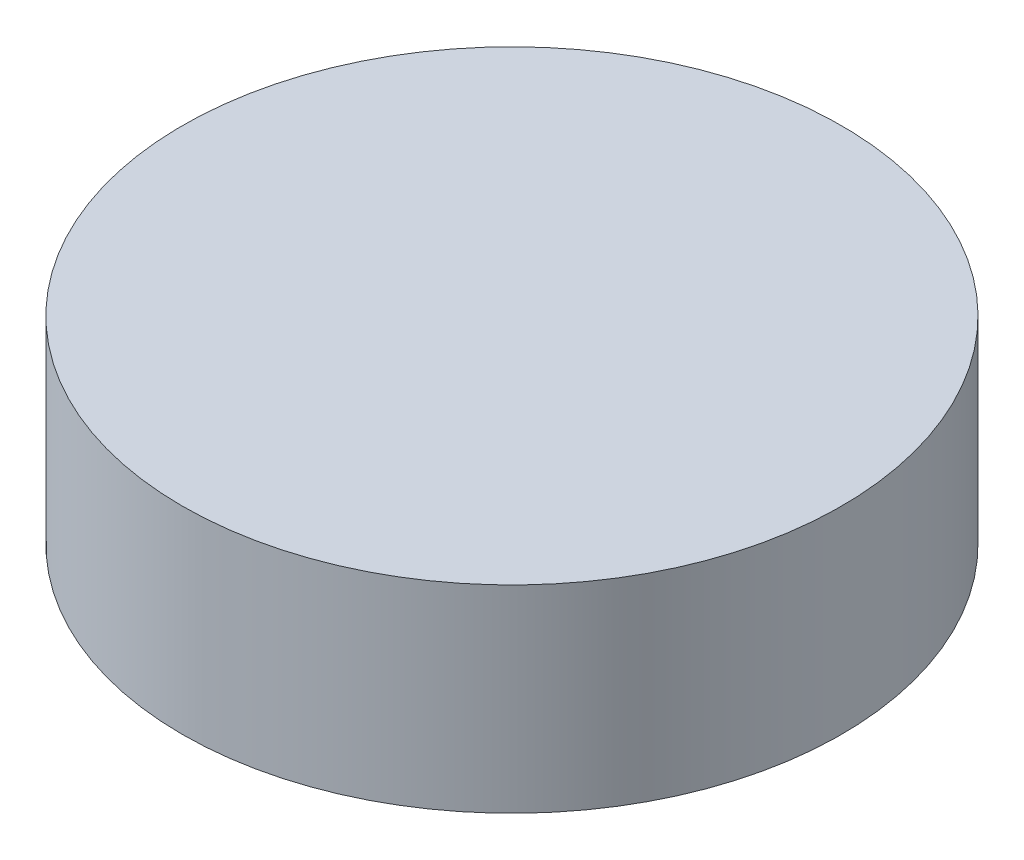
ISO-10303-21;
HEADER;
FILE_DESCRIPTION(('STEP AP214'),'2;1');
FILE_NAME('part.step','',(''),(''),'','','');
FILE_SCHEMA(('AUTOMOTIVE_DESIGN { 1 0 10303 214 1 1 1 1 }'));
ENDSEC;
DATA;
#1=APPLICATION_CONTEXT('core data for automotive mechanical design processes');
#2=APPLICATION_PROTOCOL_DEFINITION('international standard','automotive_design',2000,#1);
#3=PRODUCT_CONTEXT('',#1,'mechanical');
#4=PRODUCT('Part','Part','',(#3));
#5=PRODUCT_RELATED_PRODUCT_CATEGORY('part','',(#4));
#6=PRODUCT_DEFINITION_FORMATION('','',#4);
#7=PRODUCT_DEFINITION_CONTEXT('part definition',#1,'design');
#8=PRODUCT_DEFINITION('design','',#6,#7);
#9=PRODUCT_DEFINITION_SHAPE('','',#8);
#10=(LENGTH_UNIT() NAMED_UNIT(*) SI_UNIT(.MILLI.,.METRE.));
#11=(NAMED_UNIT(*) PLANE_ANGLE_UNIT() SI_UNIT($,.RADIAN.));
#12=(NAMED_UNIT(*) SI_UNIT($,.STERADIAN.) SOLID_ANGLE_UNIT());
#13=UNCERTAINTY_MEASURE_WITH_UNIT(LENGTH_MEASURE(1.E-05),#10,'distance_accuracy_value','');
#14=(GEOMETRIC_REPRESENTATION_CONTEXT(3) GLOBAL_UNCERTAINTY_ASSIGNED_CONTEXT((#13)) GLOBAL_UNIT_ASSIGNED_CONTEXT((#10,
#11,#12)) REPRESENTATION_CONTEXT('',''));
#15=CARTESIAN_POINT('',(0.,0.,0.));
#16=DIRECTION('',(0.,0.,1.));
#17=DIRECTION('',(1.,0.,0.));
#18=AXIS2_PLACEMENT_3D('',#15,#16,#17);
#19=CARTESIAN_POINT('',(0.,3.,0.));
#20=DIRECTION('',(0.,-1.,0.));
#21=DIRECTION('',(0.,0.,-1.));
#22=AXIS2_PLACEMENT_3D('',#19,#20,#21);
#23=CYLINDRICAL_SURFACE('',#22,10.);
#24=CARTESIAN_POINT('',(0.,3.,0.));
#25=DIRECTION('',(0.,1.,0.));
#26=DIRECTION('',(0.,0.,1.));
#27=AXIS2_PLACEMENT_3D('',#24,#25,#26);
#28=CIRCLE('',#27,10.);
#29=CARTESIAN_POINT('',(0.,3.,10.));
#30=VERTEX_POINT('',#29);
#31=EDGE_CURVE('E10',#30,#30,#28,.T.);
#32=ORIENTED_EDGE('',*,*,#31,.F.);
#33=EDGE_LOOP('',(#32));
#34=FACE_BOUND('',#33,.T.);
#35=CARTESIAN_POINT('',(0.,-3.,0.));
#36=DIRECTION('',(0.,1.,0.));
#37=DIRECTION('',(0.,0.,1.));
#38=AXIS2_PLACEMENT_3D('',#35,#36,#37);
#39=CIRCLE('',#38,10.);
#40=CARTESIAN_POINT('',(0.,-3.,10.));
#41=VERTEX_POINT('',#40);
#42=EDGE_CURVE('E36',#41,#41,#39,.T.);
#43=ORIENTED_EDGE('',*,*,#42,.T.);
#44=EDGE_LOOP('',(#43));
#45=FACE_BOUND('',#44,.T.);
#46=ADVANCED_FACE('F33',(#34,#45),#23,.T.);
#47=CARTESIAN_POINT('',(0.,3.,0.));
#48=DIRECTION('',(0.,1.,0.));
#49=DIRECTION('',(0.,0.,1.));
#50=AXIS2_PLACEMENT_3D('',#47,#48,#49);
#51=PLANE('',#50);
#52=ORIENTED_EDGE('',*,*,#31,.T.);
#53=EDGE_LOOP('',(#52));
#54=FACE_BOUND('',#53,.T.);
#55=ADVANCED_FACE('F62',(#54),#51,.T.);
#56=CARTESIAN_POINT('',(0.,-3.,0.));
#57=DIRECTION('',(0.,1.,0.));
#58=DIRECTION('',(0.,0.,1.));
#59=AXIS2_PLACEMENT_3D('',#56,#57,#58);
#60=PLANE('',#59);
#61=CARTESIAN_POINT('',(0.,-3.,0.));
#62=DIRECTION('',(0.,-1.,0.));
#63=DIRECTION('',(0.,0.,-1.));
#64=AXIS2_PLACEMENT_3D('',#61,#62,#63);
#65=CIRCLE('',#64,3.);
#66=CARTESIAN_POINT('',(0.,-3.,-3.));
#67=VERTEX_POINT('',#66);
#68=EDGE_CURVE('E45',#67,#67,#65,.T.);
#69=ORIENTED_EDGE('',*,*,#68,.F.);
#70=EDGE_LOOP('',(#69));
#71=FACE_BOUND('',#70,.T.);
#72=ORIENTED_EDGE('',*,*,#42,.F.);
#73=EDGE_LOOP('',(#72));
#74=FACE_BOUND('',#73,.T.);
#75=ADVANCED_FACE('F56',(#71,#74),#60,.F.);
#76=CARTESIAN_POINT('',(0.,0.,0.));
#77=DIRECTION('',(0.,-1.,0.));
#78=DIRECTION('',(0.,0.,-1.));
#79=AXIS2_PLACEMENT_3D('',#76,#77,#78);
#80=CYLINDRICAL_SURFACE('',#79,3.);
#81=CARTESIAN_POINT('',(0.,0.,0.));
#82=DIRECTION('',(0.,-1.,0.));
#83=DIRECTION('',(0.,0.,-1.));
#84=AXIS2_PLACEMENT_3D('',#81,#82,#83);
#85=CIRCLE('',#84,3.);
#86=CARTESIAN_POINT('',(0.,0.,-3.));
#87=VERTEX_POINT('',#86);
#88=EDGE_CURVE('E43',#87,#87,#85,.T.);
#89=ORIENTED_EDGE('',*,*,#88,.F.);
#90=EDGE_LOOP('',(#89));
#91=FACE_BOUND('',#90,.T.);
#92=ORIENTED_EDGE('',*,*,#68,.T.);
#93=EDGE_LOOP('',(#92));
#94=FACE_BOUND('',#93,.T.);
#95=ADVANCED_FACE('F53',(#91,#94),#80,.F.);
#96=CARTESIAN_POINT('',(0.,0.,0.));
#97=DIRECTION('',(0.,-1.,0.));
#98=DIRECTION('',(0.,0.,-1.));
#99=AXIS2_PLACEMENT_3D('',#96,#97,#98);
#100=PLANE('',#99);
#101=ORIENTED_EDGE('',*,*,#88,.T.);
#102=EDGE_LOOP('',(#101));
#103=FACE_BOUND('',#102,.T.);
#104=ADVANCED_FACE('F51',(#103),#100,.T.);
#105=CLOSED_SHELL('',(#46,#55,#75,#95,#104));
#106=MANIFOLD_SOLID_BREP('B2',#105);
#107=ADVANCED_BREP_SHAPE_REPRESENTATION('',(#18,#106),#14);
#108=SHAPE_DEFINITION_REPRESENTATION(#9,#107);
ENDSEC;
END-ISO-10303-21;
